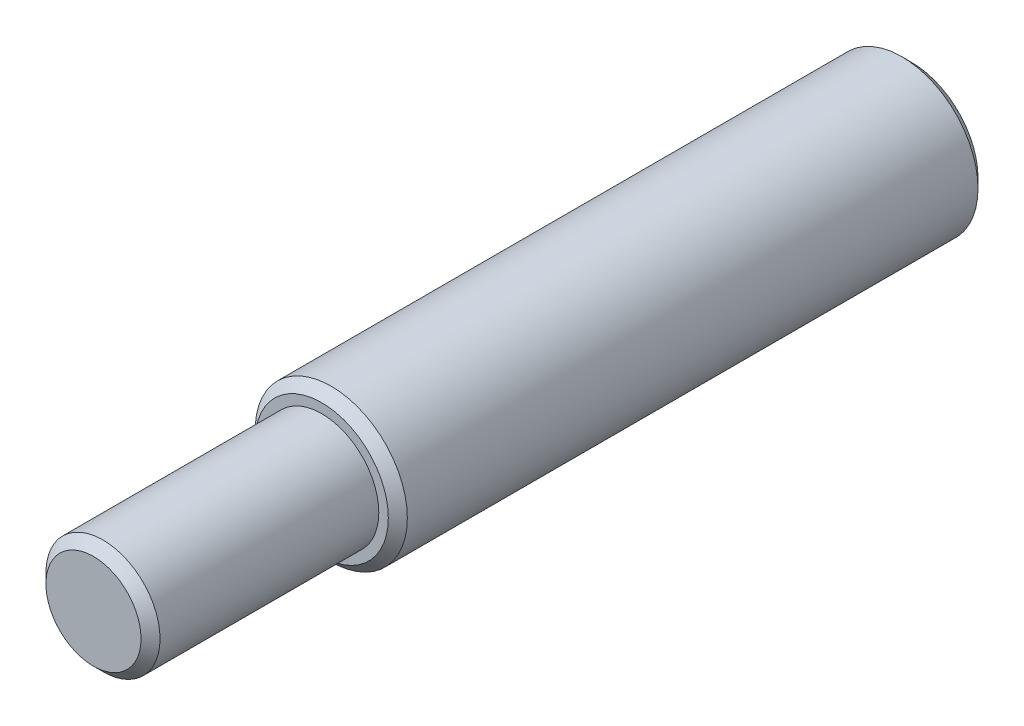
ISO-10303-21;
HEADER;
FILE_DESCRIPTION(('STEP AP214'),'2;1');
FILE_NAME('part.step','',(''),(''),'','','');
FILE_SCHEMA(('AUTOMOTIVE_DESIGN { 1 0 10303 214 1 1 1 1 }'));
ENDSEC;
DATA;
#1=APPLICATION_CONTEXT('core data for automotive mechanical design processes');
#2=APPLICATION_PROTOCOL_DEFINITION('international standard','automotive_design',2000,#1);
#3=PRODUCT_CONTEXT('',#1,'mechanical');
#4=PRODUCT('Part','Part','',(#3));
#5=PRODUCT_RELATED_PRODUCT_CATEGORY('part','',(#4));
#6=PRODUCT_DEFINITION_FORMATION('','',#4);
#7=PRODUCT_DEFINITION_CONTEXT('part definition',#1,'design');
#8=PRODUCT_DEFINITION('design','',#6,#7);
#9=PRODUCT_DEFINITION_SHAPE('','',#8);
#10=(LENGTH_UNIT() NAMED_UNIT(*) SI_UNIT(.MILLI.,.METRE.));
#11=(NAMED_UNIT(*) PLANE_ANGLE_UNIT() SI_UNIT($,.RADIAN.));
#12=(NAMED_UNIT(*) SI_UNIT($,.STERADIAN.) SOLID_ANGLE_UNIT());
#13=UNCERTAINTY_MEASURE_WITH_UNIT(LENGTH_MEASURE(1.E-05),#10,'distance_accuracy_value','');
#14=(GEOMETRIC_REPRESENTATION_CONTEXT(3) GLOBAL_UNCERTAINTY_ASSIGNED_CONTEXT((#13)) GLOBAL_UNIT_ASSIGNED_CONTEXT((#10,
#11,#12)) REPRESENTATION_CONTEXT('',''));
#15=CARTESIAN_POINT('',(0.,0.,0.));
#16=DIRECTION('',(0.,0.,1.));
#17=DIRECTION('',(1.,0.,0.));
#18=AXIS2_PLACEMENT_3D('',#15,#16,#17);
#19=CARTESIAN_POINT('',(0.,0.,31.));
#20=DIRECTION('',(0.,0.,1.));
#21=DIRECTION('',(1.,0.,0.));
#22=AXIS2_PLACEMENT_3D('',#19,#20,#21);
#23=PLANE('',#22);
#24=CARTESIAN_POINT('',(0.,0.,31.));
#25=DIRECTION('',(0.,0.,1.));
#26=DIRECTION('',(1.,0.,0.));
#27=AXIS2_PLACEMENT_3D('',#24,#25,#26);
#28=CIRCLE('',#27,3.50000000000002);
#29=CARTESIAN_POINT('',(3.50000000000002,0.,31.));
#30=VERTEX_POINT('',#29);
#31=EDGE_CURVE('E48',#30,#30,#28,.T.);
#32=ORIENTED_EDGE('',*,*,#31,.T.);
#33=EDGE_LOOP('',(#32));
#34=FACE_BOUND('',#33,.T.);
#35=CARTESIAN_POINT('',(0.,0.,31.));
#36=DIRECTION('',(0.,0.,1.));
#37=DIRECTION('',(1.,0.,0.));
#38=AXIS2_PLACEMENT_3D('',#35,#36,#37);
#39=CIRCLE('',#38,3.);
#40=CARTESIAN_POINT('',(3.,0.,31.));
#41=VERTEX_POINT('',#40);
#42=EDGE_CURVE('E59',#41,#41,#39,.T.);
#43=ORIENTED_EDGE('',*,*,#42,.F.);
#44=EDGE_LOOP('',(#43));
#45=FACE_BOUND('',#44,.T.);
#46=ADVANCED_FACE('F33',(#34,#45),#23,.T.);
#47=CARTESIAN_POINT('',(0.,0.,43.));
#48=DIRECTION('',(0.,0.,-1.));
#49=DIRECTION('',(-1.,0.,0.));
#50=AXIS2_PLACEMENT_3D('',#47,#48,#49);
#51=CYLINDRICAL_SURFACE('',#50,3.);
#52=CARTESIAN_POINT('',(0.,0.,42.5));
#53=DIRECTION('',(0.,0.,1.));
#54=DIRECTION('',(1.,0.,0.));
#55=AXIS2_PLACEMENT_3D('',#52,#53,#54);
#56=CIRCLE('',#55,3.);
#57=CARTESIAN_POINT('',(3.,0.,42.5));
#58=VERTEX_POINT('',#57);
#59=EDGE_CURVE('E53',#58,#58,#56,.F.);
#60=ORIENTED_EDGE('',*,*,#59,.T.);
#61=EDGE_LOOP('',(#60));
#62=FACE_BOUND('',#61,.T.);
#63=ORIENTED_EDGE('',*,*,#42,.T.);
#64=EDGE_LOOP('',(#63));
#65=FACE_BOUND('',#64,.T.);
#66=ADVANCED_FACE('F63',(#62,#65),#51,.T.);
#67=CARTESIAN_POINT('',(0.,0.,43.));
#68=DIRECTION('',(0.,0.,1.));
#69=DIRECTION('',(1.,0.,0.));
#70=AXIS2_PLACEMENT_3D('',#67,#68,#69);
#71=PLANE('',#70);
#72=CARTESIAN_POINT('',(0.,0.,43.));
#73=DIRECTION('',(0.,0.,1.));
#74=DIRECTION('',(1.,0.,0.));
#75=AXIS2_PLACEMENT_3D('',#72,#73,#74);
#76=CIRCLE('',#75,2.5);
#77=CARTESIAN_POINT('',(2.5,0.,43.));
#78=VERTEX_POINT('',#77);
#79=EDGE_CURVE('E56',#78,#78,#76,.T.);
#80=ORIENTED_EDGE('',*,*,#79,.T.);
#81=EDGE_LOOP('',(#80));
#82=FACE_BOUND('',#81,.T.);
#83=ADVANCED_FACE('F71',(#82),#71,.T.);
#84=CARTESIAN_POINT('',(0.,0.,43.));
#85=DIRECTION('',(0.,0.,-1.));
#86=DIRECTION('',(-1.,0.,0.));
#87=AXIS2_PLACEMENT_3D('',#84,#85,#86);
#88=CONICAL_SURFACE('',#87,2.5,0.785398163397453);
#89=ORIENTED_EDGE('',*,*,#59,.F.);
#90=EDGE_LOOP('',(#89));
#91=FACE_BOUND('',#90,.T.);
#92=ORIENTED_EDGE('',*,*,#79,.F.);
#93=EDGE_LOOP('',(#92));
#94=FACE_BOUND('',#93,.T.);
#95=ADVANCED_FACE('F83',(#91,#94),#88,.T.);
#96=CARTESIAN_POINT('',(0.,0.,31.));
#97=DIRECTION('',(0.,0.,-1.));
#98=DIRECTION('',(-1.,0.,0.));
#99=AXIS2_PLACEMENT_3D('',#96,#97,#98);
#100=CONICAL_SURFACE('',#99,3.50000000000002,0.785398163397449);
#101=CARTESIAN_POINT('',(0.,0.,30.5));
#102=DIRECTION('',(0.,0.,1.));
#103=DIRECTION('',(1.,0.,0.));
#104=AXIS2_PLACEMENT_3D('',#101,#102,#103);
#105=CIRCLE('',#104,4.);
#106=CARTESIAN_POINT('',(4.,0.,30.5));
#107=VERTEX_POINT('',#106);
#108=EDGE_CURVE('E44',#107,#107,#105,.F.);
#109=ORIENTED_EDGE('',*,*,#108,.F.);
#110=EDGE_LOOP('',(#109));
#111=FACE_BOUND('',#110,.T.);
#112=ORIENTED_EDGE('',*,*,#31,.F.);
#113=EDGE_LOOP('',(#112));
#114=FACE_BOUND('',#113,.T.);
#115=ADVANCED_FACE('F79',(#111,#114),#100,.T.);
#116=CARTESIAN_POINT('',(0.,0.,0.));
#117=DIRECTION('',(0.,0.,1.));
#118=DIRECTION('',(1.,0.,0.));
#119=AXIS2_PLACEMENT_3D('',#116,#117,#118);
#120=PLANE('',#119);
#121=CARTESIAN_POINT('',(0.,0.,0.));
#122=DIRECTION('',(0.,0.,1.));
#123=DIRECTION('',(1.,0.,0.));
#124=AXIS2_PLACEMENT_3D('',#121,#122,#123);
#125=CIRCLE('',#124,3.5);
#126=CARTESIAN_POINT('',(3.5,0.,0.));
#127=VERTEX_POINT('',#126);
#128=EDGE_CURVE('E10',#127,#127,#125,.F.);
#129=ORIENTED_EDGE('',*,*,#128,.T.);
#130=EDGE_LOOP('',(#129));
#131=FACE_BOUND('',#130,.T.);
#132=ADVANCED_FACE('F76',(#131),#120,.F.);
#133=CARTESIAN_POINT('',(0.,0.,0.499999999999999));
#134=DIRECTION('',(0.,0.,1.));
#135=DIRECTION('',(1.,0.,0.));
#136=AXIS2_PLACEMENT_3D('',#133,#134,#135);
#137=CONICAL_SURFACE('',#136,4.,0.785398163397447);
#138=ORIENTED_EDGE('',*,*,#128,.F.);
#139=EDGE_LOOP('',(#138));
#140=FACE_BOUND('',#139,.T.);
#141=CARTESIAN_POINT('',(0.,0.,0.499999999999999));
#142=DIRECTION('',(0.,0.,1.));
#143=DIRECTION('',(1.,0.,0.));
#144=AXIS2_PLACEMENT_3D('',#141,#142,#143);
#145=CIRCLE('',#144,4.);
#146=CARTESIAN_POINT('',(4.,0.,0.499999999999999));
#147=VERTEX_POINT('',#146);
#148=EDGE_CURVE('E40',#147,#147,#145,.T.);
#149=ORIENTED_EDGE('',*,*,#148,.F.);
#150=EDGE_LOOP('',(#149));
#151=FACE_BOUND('',#150,.T.);
#152=ADVANCED_FACE('F35',(#140,#151),#137,.T.);
#153=CARTESIAN_POINT('',(0.,0.,10.));
#154=DIRECTION('',(0.,0.,-1.));
#155=DIRECTION('',(-1.,0.,0.));
#156=AXIS2_PLACEMENT_3D('',#153,#154,#155);
#157=CYLINDRICAL_SURFACE('',#156,4.);
#158=ORIENTED_EDGE('',*,*,#148,.T.);
#159=EDGE_LOOP('',(#158));
#160=FACE_BOUND('',#159,.T.);
#161=ORIENTED_EDGE('',*,*,#108,.T.);
#162=EDGE_LOOP('',(#161));
#163=FACE_BOUND('',#162,.T.);
#164=ADVANCED_FACE('F80',(#160,#163),#157,.T.);
#165=CLOSED_SHELL('',(#46,#66,#83,#95,#115,#132,#152,#164));
#166=MANIFOLD_SOLID_BREP('B2',#165);
#167=ADVANCED_BREP_SHAPE_REPRESENTATION('',(#18,#166),#14);
#168=SHAPE_DEFINITION_REPRESENTATION(#9,#167);
ENDSEC;
END-ISO-10303-21;
